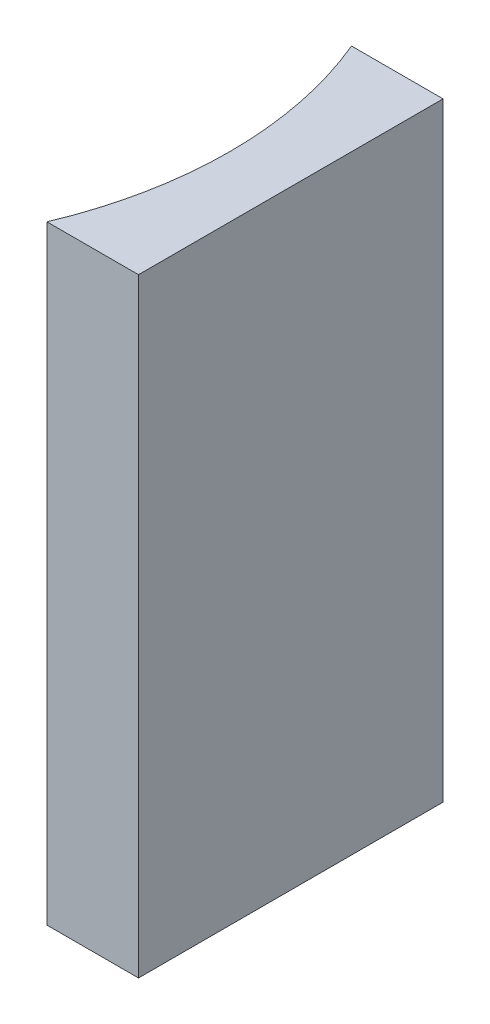
ISO-10303-21;
HEADER;
FILE_DESCRIPTION(('STEP AP214'),'2;1');
FILE_NAME('part.step','',(''),(''),'','','');
FILE_SCHEMA(('AUTOMOTIVE_DESIGN { 1 0 10303 214 1 1 1 1 }'));
ENDSEC;
DATA;
#1=APPLICATION_CONTEXT('core data for automotive mechanical design processes');
#2=APPLICATION_PROTOCOL_DEFINITION('international standard','automotive_design',2000,#1);
#3=PRODUCT_CONTEXT('',#1,'mechanical');
#4=PRODUCT('Part','Part','',(#3));
#5=PRODUCT_RELATED_PRODUCT_CATEGORY('part','',(#4));
#6=PRODUCT_DEFINITION_FORMATION('','',#4);
#7=PRODUCT_DEFINITION_CONTEXT('part definition',#1,'design');
#8=PRODUCT_DEFINITION('design','',#6,#7);
#9=PRODUCT_DEFINITION_SHAPE('','',#8);
#10=(LENGTH_UNIT() NAMED_UNIT(*) SI_UNIT(.MILLI.,.METRE.));
#11=(NAMED_UNIT(*) PLANE_ANGLE_UNIT() SI_UNIT($,.RADIAN.));
#12=(NAMED_UNIT(*) SI_UNIT($,.STERADIAN.) SOLID_ANGLE_UNIT());
#13=UNCERTAINTY_MEASURE_WITH_UNIT(LENGTH_MEASURE(1.E-05),#10,'distance_accuracy_value','');
#14=(GEOMETRIC_REPRESENTATION_CONTEXT(3) GLOBAL_UNCERTAINTY_ASSIGNED_CONTEXT((#13)) GLOBAL_UNIT_ASSIGNED_CONTEXT((#10,
#11,#12)) REPRESENTATION_CONTEXT('',''));
#15=CARTESIAN_POINT('',(0.,0.,0.));
#16=DIRECTION('',(0.,0.,1.));
#17=DIRECTION('',(1.,0.,0.));
#18=AXIS2_PLACEMENT_3D('',#15,#16,#17);
#19=CARTESIAN_POINT('',(0.,20.,0.));
#20=DIRECTION('',(0.,0.,1.));
#21=DIRECTION('',(1.,0.,0.));
#22=AXIS2_PLACEMENT_3D('',#19,#20,#21);
#23=PLANE('',#22);
#24=DIRECTION('',(-1.,0.,0.));
#25=VECTOR('',#24,1.);
#26=CARTESIAN_POINT('',(0.,0.,0.));
#27=LINE('',#26,#25);
#28=CARTESIAN_POINT('',(0.,0.,0.));
#29=VERTEX_POINT('',#28);
#30=CARTESIAN_POINT('',(-3.00586900440959,0.,0.));
#31=VERTEX_POINT('',#30);
#32=EDGE_CURVE('E100',#29,#31,#27,.T.);
#33=ORIENTED_EDGE('',*,*,#32,.T.);
#34=DIRECTION('',(0.,-1.,0.));
#35=VECTOR('',#34,1.);
#36=CARTESIAN_POINT('',(-3.00586900440959,20.,0.));
#37=LINE('',#36,#35);
#38=CARTESIAN_POINT('',(-3.00586900440959,20.,0.));
#39=VERTEX_POINT('',#38);
#40=EDGE_CURVE('E11',#39,#31,#37,.T.);
#41=ORIENTED_EDGE('',*,*,#40,.F.);
#42=DIRECTION('',(-1.,0.,0.));
#43=VECTOR('',#42,1.);
#44=CARTESIAN_POINT('',(0.,20.,0.));
#45=LINE('',#44,#43);
#46=CARTESIAN_POINT('',(0.,20.,0.));
#47=VERTEX_POINT('',#46);
#48=EDGE_CURVE('E88',#47,#39,#45,.T.);
#49=ORIENTED_EDGE('',*,*,#48,.F.);
#50=DIRECTION('',(0.,-1.,0.));
#51=VECTOR('',#50,1.);
#52=CARTESIAN_POINT('',(0.,20.,0.));
#53=LINE('',#52,#51);
#54=EDGE_CURVE('E96',#47,#29,#53,.T.);
#55=ORIENTED_EDGE('',*,*,#54,.T.);
#56=EDGE_LOOP('',(#33,#41,#49,#55));
#57=FACE_BOUND('',#56,.T.);
#58=ADVANCED_FACE('F37',(#57),#23,.F.);
#59=CARTESIAN_POINT('',(-14.93,20.,5.));
#60=DIRECTION('',(0.,-1.,0.));
#61=DIRECTION('',(0.,0.,-1.));
#62=AXIS2_PLACEMENT_3D('',#59,#60,#61);
#63=CYLINDRICAL_SURFACE('',#62,12.93);
#64=CARTESIAN_POINT('',(-14.93,0.,5.));
#65=DIRECTION('',(0.,-1.,0.));
#66=DIRECTION('',(0.,0.,1.));
#67=AXIS2_PLACEMENT_3D('',#64,#65,#66);
#68=CIRCLE('',#67,12.93);
#69=CARTESIAN_POINT('',(-3.00586900440959,0.,10.));
#70=VERTEX_POINT('',#69);
#71=EDGE_CURVE('E92',#31,#70,#68,.T.);
#72=ORIENTED_EDGE('',*,*,#71,.T.);
#73=DIRECTION('',(0.,-1.,0.));
#74=VECTOR('',#73,1.);
#75=CARTESIAN_POINT('',(-3.00586900440959,20.,10.));
#76=LINE('',#75,#74);
#77=CARTESIAN_POINT('',(-3.00586900440959,20.,10.));
#78=VERTEX_POINT('',#77);
#79=EDGE_CURVE('E45',#78,#70,#76,.T.);
#80=ORIENTED_EDGE('',*,*,#79,.F.);
#81=CARTESIAN_POINT('',(-14.93,20.,5.));
#82=DIRECTION('',(0.,-1.,0.));
#83=DIRECTION('',(0.,0.,1.));
#84=AXIS2_PLACEMENT_3D('',#81,#82,#83);
#85=CIRCLE('',#84,12.93);
#86=EDGE_CURVE('E83',#39,#78,#85,.T.);
#87=ORIENTED_EDGE('',*,*,#86,.F.);
#88=ORIENTED_EDGE('',*,*,#40,.T.);
#89=EDGE_LOOP('',(#72,#80,#87,#88));
#90=FACE_BOUND('',#89,.T.);
#91=ADVANCED_FACE('F91',(#90),#63,.F.);
#92=CARTESIAN_POINT('',(0.,20.,10.));
#93=DIRECTION('',(0.,0.,-1.));
#94=DIRECTION('',(-1.,0.,0.));
#95=AXIS2_PLACEMENT_3D('',#92,#93,#94);
#96=PLANE('',#95);
#97=DIRECTION('',(1.,0.,0.));
#98=VECTOR('',#97,1.);
#99=CARTESIAN_POINT('',(0.,0.,10.));
#100=LINE('',#99,#98);
#101=CARTESIAN_POINT('',(0.,0.,10.));
#102=VERTEX_POINT('',#101);
#103=EDGE_CURVE('E70',#70,#102,#100,.T.);
#104=ORIENTED_EDGE('',*,*,#103,.T.);
#105=DIRECTION('',(0.,-1.,0.));
#106=VECTOR('',#105,1.);
#107=CARTESIAN_POINT('',(0.,20.,10.));
#108=LINE('',#107,#106);
#109=CARTESIAN_POINT('',(0.,20.,10.));
#110=VERTEX_POINT('',#109);
#111=EDGE_CURVE('E93',#110,#102,#108,.T.);
#112=ORIENTED_EDGE('',*,*,#111,.F.);
#113=DIRECTION('',(1.,0.,0.));
#114=VECTOR('',#113,1.);
#115=CARTESIAN_POINT('',(0.,20.,10.));
#116=LINE('',#115,#114);
#117=EDGE_CURVE('E86',#78,#110,#116,.T.);
#118=ORIENTED_EDGE('',*,*,#117,.F.);
#119=ORIENTED_EDGE('',*,*,#79,.T.);
#120=EDGE_LOOP('',(#104,#112,#118,#119));
#121=FACE_BOUND('',#120,.T.);
#122=ADVANCED_FACE('F94',(#121),#96,.F.);
#123=CARTESIAN_POINT('',(0.,20.,0.));
#124=DIRECTION('',(-1.,0.,0.));
#125=DIRECTION('',(0.,0.,1.));
#126=AXIS2_PLACEMENT_3D('',#123,#124,#125);
#127=PLANE('',#126);
#128=DIRECTION('',(0.,0.,-1.));
#129=VECTOR('',#128,1.);
#130=CARTESIAN_POINT('',(0.,0.,0.));
#131=LINE('',#130,#129);
#132=EDGE_CURVE('E76',#102,#29,#131,.T.);
#133=ORIENTED_EDGE('',*,*,#132,.T.);
#134=ORIENTED_EDGE('',*,*,#54,.F.);
#135=DIRECTION('',(0.,0.,-1.));
#136=VECTOR('',#135,1.);
#137=CARTESIAN_POINT('',(0.,20.,0.));
#138=LINE('',#137,#136);
#139=EDGE_CURVE('E53',#110,#47,#138,.T.);
#140=ORIENTED_EDGE('',*,*,#139,.F.);
#141=ORIENTED_EDGE('',*,*,#111,.T.);
#142=EDGE_LOOP('',(#133,#134,#140,#141));
#143=FACE_BOUND('',#142,.T.);
#144=ADVANCED_FACE('F107',(#143),#127,.F.);
#145=CARTESIAN_POINT('',(-14.93,20.,5.));
#146=DIRECTION('',(0.,1.,0.));
#147=DIRECTION('',(0.,0.,1.));
#148=AXIS2_PLACEMENT_3D('',#145,#146,#147);
#149=PLANE('',#148);
#150=ORIENTED_EDGE('',*,*,#48,.T.);
#151=ORIENTED_EDGE('',*,*,#86,.T.);
#152=ORIENTED_EDGE('',*,*,#117,.T.);
#153=ORIENTED_EDGE('',*,*,#139,.T.);
#154=EDGE_LOOP('',(#150,#151,#152,#153));
#155=FACE_BOUND('',#154,.T.);
#156=ADVANCED_FACE('F84',(#155),#149,.T.);
#157=CARTESIAN_POINT('',(-14.93,0.,5.));
#158=DIRECTION('',(0.,1.,0.));
#159=DIRECTION('',(0.,0.,1.));
#160=AXIS2_PLACEMENT_3D('',#157,#158,#159);
#161=PLANE('',#160);
#162=ORIENTED_EDGE('',*,*,#32,.F.);
#163=ORIENTED_EDGE('',*,*,#132,.F.);
#164=ORIENTED_EDGE('',*,*,#103,.F.);
#165=ORIENTED_EDGE('',*,*,#71,.F.);
#166=EDGE_LOOP('',(#162,#163,#164,#165));
#167=FACE_BOUND('',#166,.T.);
#168=ADVANCED_FACE('F110',(#167),#161,.F.);
#169=CLOSED_SHELL('',(#58,#91,#122,#144,#156,#168));
#170=MANIFOLD_SOLID_BREP('B2',#169);
#171=ADVANCED_BREP_SHAPE_REPRESENTATION('',(#18,#170),#14);
#172=SHAPE_DEFINITION_REPRESENTATION(#9,#171);
ENDSEC;
END-ISO-10303-21;
